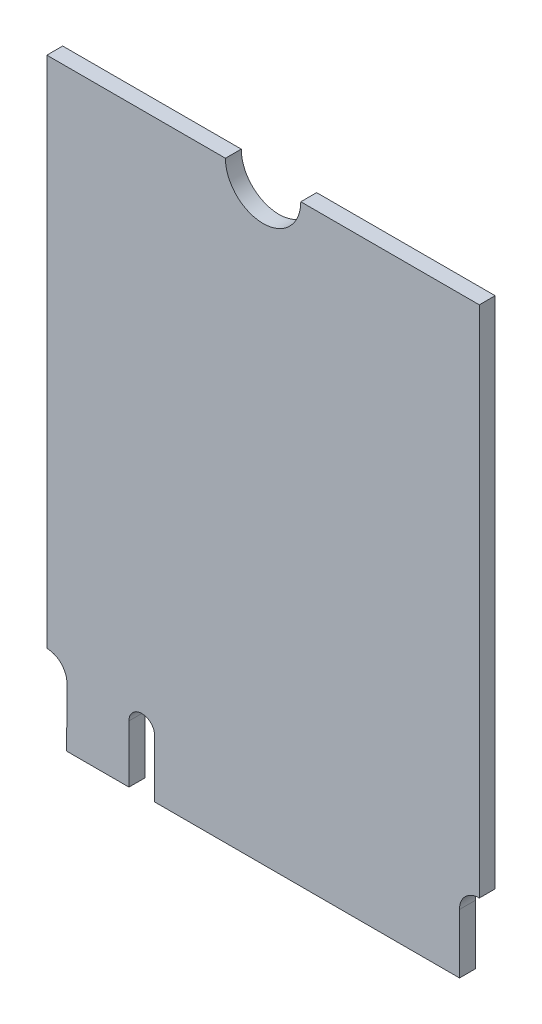
ISO-10303-21;
HEADER;
FILE_DESCRIPTION(('STEP AP214'),'2;1');
FILE_NAME('part.step','',(''),(''),'','','');
FILE_SCHEMA(('AUTOMOTIVE_DESIGN { 1 0 10303 214 1 1 1 1 }'));
ENDSEC;
DATA;
#1=APPLICATION_CONTEXT('core data for automotive mechanical design processes');
#2=APPLICATION_PROTOCOL_DEFINITION('international standard','automotive_design',2000,#1);
#3=PRODUCT_CONTEXT('',#1,'mechanical');
#4=PRODUCT('Part','Part','',(#3));
#5=PRODUCT_RELATED_PRODUCT_CATEGORY('part','',(#4));
#6=PRODUCT_DEFINITION_FORMATION('','',#4);
#7=PRODUCT_DEFINITION_CONTEXT('part definition',#1,'design');
#8=PRODUCT_DEFINITION('design','',#6,#7);
#9=PRODUCT_DEFINITION_SHAPE('','',#8);
#10=(LENGTH_UNIT() NAMED_UNIT(*) SI_UNIT(.MILLI.,.METRE.));
#11=(NAMED_UNIT(*) PLANE_ANGLE_UNIT() SI_UNIT($,.RADIAN.));
#12=(NAMED_UNIT(*) SI_UNIT($,.STERADIAN.) SOLID_ANGLE_UNIT());
#13=UNCERTAINTY_MEASURE_WITH_UNIT(LENGTH_MEASURE(1.E-05),#10,'distance_accuracy_value','');
#14=(GEOMETRIC_REPRESENTATION_CONTEXT(3) GLOBAL_UNCERTAINTY_ASSIGNED_CONTEXT((#13)) GLOBAL_UNIT_ASSIGNED_CONTEXT((#10,
#11,#12)) REPRESENTATION_CONTEXT('',''));
#15=CARTESIAN_POINT('',(0.,0.,0.));
#16=DIRECTION('',(0.,0.,1.));
#17=DIRECTION('',(1.,0.,0.));
#18=AXIS2_PLACEMENT_3D('',#15,#16,#17);
#19=CARTESIAN_POINT('',(41.631999969482,40.89400100708,0.));
#20=DIRECTION('',(-0.99998563687939,0.00535966742629409,0.));
#21=DIRECTION('',(0.00535966742629409,0.99998563687939,0.));
#22=AXIS2_PLACEMENT_3D('',#19,#20,#21);
#23=PLANE('',#22);
#24=DIRECTION('',(0.,0.,1.));
#25=VECTOR('',#24,1.);
#26=CARTESIAN_POINT('',(41.631999969482,40.89400100708,0.));
#27=LINE('',#26,#25);
#28=CARTESIAN_POINT('',(41.631999969482,40.89400100708,0.));
#29=VERTEX_POINT('',#28);
#30=CARTESIAN_POINT('',(41.631999969482,40.89400100708,0.80000094));
#31=VERTEX_POINT('',#30);
#32=EDGE_CURVE('E11',#29,#31,#27,.T.);
#33=ORIENTED_EDGE('',*,*,#32,.T.);
#34=DIRECTION('',(0.00535966742629409,0.99998563687939,0.));
#35=VECTOR('',#34,1.);
#36=CARTESIAN_POINT('',(41.631999969482,40.89400100708,0.80000094));
#37=LINE('',#36,#35);
#38=CARTESIAN_POINT('',(41.647998809814,43.879001617432,0.80000094));
#39=VERTEX_POINT('',#38);
#40=EDGE_CURVE('E25',#31,#39,#37,.T.);
#41=ORIENTED_EDGE('',*,*,#40,.T.);
#42=DIRECTION('',(0.,0.,1.));
#43=VECTOR('',#42,1.);
#44=CARTESIAN_POINT('',(41.647998809814,43.879001617432,0.));
#45=LINE('',#44,#43);
#46=CARTESIAN_POINT('',(41.647998809814,43.879001617432,0.));
#47=VERTEX_POINT('',#46);
#48=EDGE_CURVE('E136',#47,#39,#45,.T.);
#49=ORIENTED_EDGE('',*,*,#48,.F.);
#50=DIRECTION('',(0.00535966742629409,0.99998563687939,0.));
#51=VECTOR('',#50,1.);
#52=CARTESIAN_POINT('',(41.631999969482,40.89400100708,0.));
#53=LINE('',#52,#51);
#54=EDGE_CURVE('E251',#29,#47,#53,.T.);
#55=ORIENTED_EDGE('',*,*,#54,.F.);
#56=EDGE_LOOP('',(#33,#41,#49,#55));
#57=FACE_BOUND('',#56,.T.);
#58=ADVANCED_FACE('F17',(#57),#23,.T.);
#59=CARTESIAN_POINT('',(51.20604516011,55.499784448257,0.));
#60=DIRECTION('',(0.,0.,-1.));
#61=DIRECTION('',(-1.,0.,0.));
#62=AXIS2_PLACEMENT_3D('',#59,#60,#61);
#63=PLANE('',#62);
#64=ORIENTED_EDGE('',*,*,#54,.T.);
#65=CARTESIAN_POINT('',(40.632275211298,43.879276859248,0.));
#66=DIRECTION('',(0.,0.,1.));
#67=DIRECTION('',(0.999999963284646,-0.000270981009192204,0.));
#68=AXIS2_PLACEMENT_3D('',#65,#66,#67);
#69=CIRCLE('',#68,1.015723635809);
#70=CARTESIAN_POINT('',(40.631999969482,44.895000457764,0.));
#71=VERTEX_POINT('',#70);
#72=EDGE_CURVE('E247',#47,#71,#69,.T.);
#73=ORIENTED_EDGE('',*,*,#72,.T.);
#74=DIRECTION('',(0.,1.,0.));
#75=VECTOR('',#74,1.);
#76=CARTESIAN_POINT('',(40.631999969482,44.895000457764,0.));
#77=LINE('',#76,#75);
#78=CARTESIAN_POINT('',(40.631999969482,70.862998962402,0.));
#79=VERTEX_POINT('',#78);
#80=EDGE_CURVE('E130',#71,#79,#77,.T.);
#81=ORIENTED_EDGE('',*,*,#80,.T.);
#82=DIRECTION('',(1.,0.,0.));
#83=VECTOR('',#82,1.);
#84=CARTESIAN_POINT('',(40.631999969482,70.862998962402,0.));
#85=LINE('',#84,#83);
#86=CARTESIAN_POINT('',(49.658000946045,70.862998962402,0.));
#87=VERTEX_POINT('',#86);
#88=EDGE_CURVE('E240',#79,#87,#85,.T.);
#89=ORIENTED_EDGE('',*,*,#88,.T.);
#90=CARTESIAN_POINT('',(51.562999725342,70.862998962402,0.));
#91=DIRECTION('',(0.,0.,1.));
#92=DIRECTION('',(-1.,0.,0.));
#93=AXIS2_PLACEMENT_3D('',#90,#91,#92);
#94=CIRCLE('',#93,1.904998779297);
#95=CARTESIAN_POINT('',(53.467998504639,70.862998962402,0.));
#96=VERTEX_POINT('',#95);
#97=EDGE_CURVE('E236',#87,#96,#94,.T.);
#98=ORIENTED_EDGE('',*,*,#97,.T.);
#99=DIRECTION('',(1.,0.,0.));
#100=VECTOR('',#99,1.);
#101=CARTESIAN_POINT('',(53.467998504639,70.862998962402,0.));
#102=LINE('',#101,#100);
#103=CARTESIAN_POINT('',(62.492000579834,70.862998962402,0.));
#104=VERTEX_POINT('',#103);
#105=EDGE_CURVE('E232',#96,#104,#102,.T.);
#106=ORIENTED_EDGE('',*,*,#105,.T.);
#107=DIRECTION('',(0.,-1.,0.));
#108=VECTOR('',#107,1.);
#109=CARTESIAN_POINT('',(62.492000579834,70.862998962402,0.));
#110=LINE('',#109,#108);
#111=CARTESIAN_POINT('',(62.492000579834,44.89400100708,0.));
#112=VERTEX_POINT('',#111);
#113=EDGE_CURVE('E228',#104,#112,#110,.T.);
#114=ORIENTED_EDGE('',*,*,#113,.T.);
#115=CARTESIAN_POINT('',(62.482082937081,43.903918649833,0.));
#116=DIRECTION('',(0.,0.,1.));
#117=DIRECTION('',(0.0100164851431336,0.999949833754363,0.));
#118=AXIS2_PLACEMENT_3D('',#115,#116,#117);
#119=CIRCLE('',#118,0.990132028454);
#120=CARTESIAN_POINT('',(61.492000579834,43.89400100708,0.));
#121=VERTEX_POINT('',#120);
#122=EDGE_CURVE('E224',#112,#121,#119,.T.);
#123=ORIENTED_EDGE('',*,*,#122,.T.);
#124=DIRECTION('',(0.,-1.,0.));
#125=VECTOR('',#124,1.);
#126=CARTESIAN_POINT('',(61.492000579834,43.89400100708,0.));
#127=LINE('',#126,#125);
#128=CARTESIAN_POINT('',(61.492000579834,40.89400100708,0.));
#129=VERTEX_POINT('',#128);
#130=EDGE_CURVE('E220',#121,#129,#127,.T.);
#131=ORIENTED_EDGE('',*,*,#130,.T.);
#132=DIRECTION('',(-1.,0.,0.));
#133=VECTOR('',#132,1.);
#134=CARTESIAN_POINT('',(61.492000579834,40.89400100708,0.));
#135=LINE('',#134,#133);
#136=CARTESIAN_POINT('',(46.082000732422,40.89400100708,0.));
#137=VERTEX_POINT('',#136);
#138=EDGE_CURVE('E216',#129,#137,#135,.T.);
#139=ORIENTED_EDGE('',*,*,#138,.T.);
#140=DIRECTION('',(0.,1.,0.));
#141=VECTOR('',#140,1.);
#142=CARTESIAN_POINT('',(46.082000732422,40.89400100708,0.));
#143=LINE('',#142,#141);
#144=CARTESIAN_POINT('',(46.082000732422,43.793998718262,0.));
#145=VERTEX_POINT('',#144);
#146=EDGE_CURVE('E212',#137,#145,#143,.T.);
#147=ORIENTED_EDGE('',*,*,#146,.T.);
#148=CARTESIAN_POINT('',(45.432001113892,43.79400062561,0.));
#149=DIRECTION('',(0.,0.,1.));
#150=DIRECTION('',(0.999999999995695,-2.9343842341261E-06,0.));
#151=AXIS2_PLACEMENT_3D('',#148,#149,#150);
#152=CIRCLE('',#151,0.649999618533);
#153=CARTESIAN_POINT('',(44.782001495361,43.793998718262,0.));
#154=VERTEX_POINT('',#153);
#155=EDGE_CURVE('E208',#145,#154,#152,.T.);
#156=ORIENTED_EDGE('',*,*,#155,.T.);
#157=DIRECTION('',(0.,-1.,0.));
#158=VECTOR('',#157,1.);
#159=CARTESIAN_POINT('',(44.782001495361,43.793998718262,0.));
#160=LINE('',#159,#158);
#161=CARTESIAN_POINT('',(44.782001495361,40.89400100708,0.));
#162=VERTEX_POINT('',#161);
#163=EDGE_CURVE('E204',#154,#162,#160,.T.);
#164=ORIENTED_EDGE('',*,*,#163,.T.);
#165=DIRECTION('',(-1.,0.,0.));
#166=VECTOR('',#165,1.);
#167=CARTESIAN_POINT('',(44.782001495361,40.89400100708,0.));
#168=LINE('',#167,#166);
#169=EDGE_CURVE('E199',#162,#29,#168,.T.);
#170=ORIENTED_EDGE('',*,*,#169,.T.);
#171=EDGE_LOOP('',(#64,#73,#81,#89,#98,#106,#114,#123,#131,#139,#147,#156,#164,#170));
#172=FACE_BOUND('',#171,.T.);
#173=ADVANCED_FACE('F264',(#172),#63,.T.);
#174=CARTESIAN_POINT('',(44.782001495361,40.89400100708,0.));
#175=DIRECTION('',(0.,-1.,0.));
#176=DIRECTION('',(-1.,0.,0.));
#177=AXIS2_PLACEMENT_3D('',#174,#175,#176);
#178=PLANE('',#177);
#179=DIRECTION('',(0.,0.,1.));
#180=VECTOR('',#179,1.);
#181=CARTESIAN_POINT('',(44.782001495361,40.89400100708,0.));
#182=LINE('',#181,#180);
#183=CARTESIAN_POINT('',(44.782001495361,40.89400100708,0.80000094));
#184=VERTEX_POINT('',#183);
#185=EDGE_CURVE('E195',#162,#184,#182,.T.);
#186=ORIENTED_EDGE('',*,*,#185,.T.);
#187=DIRECTION('',(-1.,0.,0.));
#188=VECTOR('',#187,1.);
#189=CARTESIAN_POINT('',(44.782001495361,40.89400100708,0.80000094));
#190=LINE('',#189,#188);
#191=EDGE_CURVE('E191',#184,#31,#190,.T.);
#192=ORIENTED_EDGE('',*,*,#191,.T.);
#193=ORIENTED_EDGE('',*,*,#32,.F.);
#194=ORIENTED_EDGE('',*,*,#169,.F.);
#195=EDGE_LOOP('',(#186,#192,#193,#194));
#196=FACE_BOUND('',#195,.T.);
#197=ADVANCED_FACE('F271',(#196),#178,.T.);
#198=CARTESIAN_POINT('',(51.20604516011,55.499784448257,0.80000094));
#199=DIRECTION('',(0.,0.,-1.));
#200=DIRECTION('',(-1.,0.,0.));
#201=AXIS2_PLACEMENT_3D('',#198,#199,#200);
#202=PLANE('',#201);
#203=ORIENTED_EDGE('',*,*,#191,.F.);
#204=DIRECTION('',(0.,-1.,0.));
#205=VECTOR('',#204,1.);
#206=CARTESIAN_POINT('',(44.782001495361,43.793998718262,0.80000094));
#207=LINE('',#206,#205);
#208=CARTESIAN_POINT('',(44.782001495361,43.793998718262,0.80000094));
#209=VERTEX_POINT('',#208);
#210=EDGE_CURVE('E186',#209,#184,#207,.T.);
#211=ORIENTED_EDGE('',*,*,#210,.F.);
#212=CARTESIAN_POINT('',(45.432001113892,43.79400062561,0.80000094));
#213=DIRECTION('',(0.,0.,1.));
#214=DIRECTION('',(0.999999999995695,-2.9343842341261E-06,0.));
#215=AXIS2_PLACEMENT_3D('',#212,#213,#214);
#216=CIRCLE('',#215,0.649999618533);
#217=CARTESIAN_POINT('',(46.082000732422,43.793998718262,0.80000094));
#218=VERTEX_POINT('',#217);
#219=EDGE_CURVE('E181',#218,#209,#216,.T.);
#220=ORIENTED_EDGE('',*,*,#219,.F.);
#221=DIRECTION('',(0.,1.,0.));
#222=VECTOR('',#221,1.);
#223=CARTESIAN_POINT('',(46.082000732422,40.89400100708,0.80000094));
#224=LINE('',#223,#222);
#225=CARTESIAN_POINT('',(46.082000732422,40.89400100708,0.80000094));
#226=VERTEX_POINT('',#225);
#227=EDGE_CURVE('E176',#226,#218,#224,.T.);
#228=ORIENTED_EDGE('',*,*,#227,.F.);
#229=DIRECTION('',(-1.,0.,0.));
#230=VECTOR('',#229,1.);
#231=CARTESIAN_POINT('',(61.492000579834,40.89400100708,0.80000094));
#232=LINE('',#231,#230);
#233=CARTESIAN_POINT('',(61.492000579834,40.89400100708,0.80000094));
#234=VERTEX_POINT('',#233);
#235=EDGE_CURVE('E171',#234,#226,#232,.T.);
#236=ORIENTED_EDGE('',*,*,#235,.F.);
#237=DIRECTION('',(0.,-1.,0.));
#238=VECTOR('',#237,1.);
#239=CARTESIAN_POINT('',(61.492000579834,43.89400100708,0.80000094));
#240=LINE('',#239,#238);
#241=CARTESIAN_POINT('',(61.492000579834,43.89400100708,0.80000094));
#242=VERTEX_POINT('',#241);
#243=EDGE_CURVE('E166',#242,#234,#240,.T.);
#244=ORIENTED_EDGE('',*,*,#243,.F.);
#245=CARTESIAN_POINT('',(62.482082937081,43.903918649833,0.80000094));
#246=DIRECTION('',(0.,0.,1.));
#247=DIRECTION('',(0.0100164851431336,0.999949833754363,0.));
#248=AXIS2_PLACEMENT_3D('',#245,#246,#247);
#249=CIRCLE('',#248,0.990132028454);
#250=CARTESIAN_POINT('',(62.492000579834,44.89400100708,0.80000094));
#251=VERTEX_POINT('',#250);
#252=EDGE_CURVE('E161',#251,#242,#249,.T.);
#253=ORIENTED_EDGE('',*,*,#252,.F.);
#254=DIRECTION('',(0.,-1.,0.));
#255=VECTOR('',#254,1.);
#256=CARTESIAN_POINT('',(62.492000579834,70.862998962402,0.80000094));
#257=LINE('',#256,#255);
#258=CARTESIAN_POINT('',(62.492000579834,70.862998962402,0.80000094));
#259=VERTEX_POINT('',#258);
#260=EDGE_CURVE('E156',#259,#251,#257,.T.);
#261=ORIENTED_EDGE('',*,*,#260,.F.);
#262=DIRECTION('',(1.,0.,0.));
#263=VECTOR('',#262,1.);
#264=CARTESIAN_POINT('',(53.467998504639,70.862998962402,0.80000094));
#265=LINE('',#264,#263);
#266=CARTESIAN_POINT('',(53.467998504639,70.862998962402,0.80000094));
#267=VERTEX_POINT('',#266);
#268=EDGE_CURVE('E151',#267,#259,#265,.T.);
#269=ORIENTED_EDGE('',*,*,#268,.F.);
#270=CARTESIAN_POINT('',(51.562999725342,70.862998962402,0.80000094));
#271=DIRECTION('',(0.,0.,1.));
#272=DIRECTION('',(-1.,0.,0.));
#273=AXIS2_PLACEMENT_3D('',#270,#271,#272);
#274=CIRCLE('',#273,1.904998779297);
#275=CARTESIAN_POINT('',(49.658000946045,70.862998962402,0.80000094));
#276=VERTEX_POINT('',#275);
#277=EDGE_CURVE('E146',#276,#267,#274,.T.);
#278=ORIENTED_EDGE('',*,*,#277,.F.);
#279=DIRECTION('',(1.,0.,0.));
#280=VECTOR('',#279,1.);
#281=CARTESIAN_POINT('',(40.631999969482,70.862998962402,0.80000094));
#282=LINE('',#281,#280);
#283=CARTESIAN_POINT('',(40.631999969482,70.862998962402,0.80000094));
#284=VERTEX_POINT('',#283);
#285=EDGE_CURVE('E121',#284,#276,#282,.T.);
#286=ORIENTED_EDGE('',*,*,#285,.F.);
#287=DIRECTION('',(0.,1.,0.));
#288=VECTOR('',#287,1.);
#289=CARTESIAN_POINT('',(40.631999969482,44.895000457764,0.80000094));
#290=LINE('',#289,#288);
#291=CARTESIAN_POINT('',(40.631999969482,44.895000457764,0.80000094));
#292=VERTEX_POINT('',#291);
#293=EDGE_CURVE('E113',#292,#284,#290,.T.);
#294=ORIENTED_EDGE('',*,*,#293,.F.);
#295=CARTESIAN_POINT('',(40.632275211298,43.879276859248,0.80000094));
#296=DIRECTION('',(0.,0.,1.));
#297=DIRECTION('',(0.999999963284646,-0.000270981009192204,0.));
#298=AXIS2_PLACEMENT_3D('',#295,#296,#297);
#299=CIRCLE('',#298,1.015723635809);
#300=EDGE_CURVE('E118',#39,#292,#299,.T.);
#301=ORIENTED_EDGE('',*,*,#300,.F.);
#302=ORIENTED_EDGE('',*,*,#40,.F.);
#303=EDGE_LOOP('',(#203,#211,#220,#228,#236,#244,#253,#261,#269,#278,#286,#294,#301,#302));
#304=FACE_BOUND('',#303,.T.);
#305=ADVANCED_FACE('F116',(#304),#202,.F.);
#306=CARTESIAN_POINT('',(40.632275211298,43.879276859248,0.));
#307=DIRECTION('',(0.,0.,-1.));
#308=DIRECTION('',(-0.707106781186548,-0.707106781186547,0.));
#309=AXIS2_PLACEMENT_3D('',#306,#307,#308);
#310=CYLINDRICAL_SURFACE('',#309,1.015723635809);
#311=ORIENTED_EDGE('',*,*,#48,.T.);
#312=ORIENTED_EDGE('',*,*,#300,.T.);
#313=DIRECTION('',(0.,0.,1.));
#314=VECTOR('',#313,1.);
#315=CARTESIAN_POINT('',(40.631999969482,44.895000457764,0.));
#316=LINE('',#315,#314);
#317=EDGE_CURVE('E128',#71,#292,#316,.T.);
#318=ORIENTED_EDGE('',*,*,#317,.F.);
#319=ORIENTED_EDGE('',*,*,#72,.F.);
#320=EDGE_LOOP('',(#311,#312,#318,#319));
#321=FACE_BOUND('',#320,.T.);
#322=ADVANCED_FACE('F135',(#321),#310,.F.);
#323=CARTESIAN_POINT('',(40.631999969482,44.895000457764,0.));
#324=DIRECTION('',(-1.,0.,0.));
#325=DIRECTION('',(0.,1.,0.));
#326=AXIS2_PLACEMENT_3D('',#323,#324,#325);
#327=PLANE('',#326);
#328=ORIENTED_EDGE('',*,*,#317,.T.);
#329=ORIENTED_EDGE('',*,*,#293,.T.);
#330=DIRECTION('',(0.,0.,1.));
#331=VECTOR('',#330,1.);
#332=CARTESIAN_POINT('',(40.631999969482,70.862998962402,0.));
#333=LINE('',#332,#331);
#334=EDGE_CURVE('E133',#79,#284,#333,.T.);
#335=ORIENTED_EDGE('',*,*,#334,.F.);
#336=ORIENTED_EDGE('',*,*,#80,.F.);
#337=EDGE_LOOP('',(#328,#329,#335,#336));
#338=FACE_BOUND('',#337,.T.);
#339=ADVANCED_FACE('F129',(#338),#327,.T.);
#340=CARTESIAN_POINT('',(40.631999969482,70.862998962402,0.));
#341=DIRECTION('',(0.,1.,0.));
#342=DIRECTION('',(1.,0.,0.));
#343=AXIS2_PLACEMENT_3D('',#340,#341,#342);
#344=PLANE('',#343);
#345=ORIENTED_EDGE('',*,*,#334,.T.);
#346=ORIENTED_EDGE('',*,*,#285,.T.);
#347=DIRECTION('',(0.,0.,1.));
#348=VECTOR('',#347,1.);
#349=CARTESIAN_POINT('',(49.658000946045,70.862998962402,0.));
#350=LINE('',#349,#348);
#351=EDGE_CURVE('E368',#87,#276,#350,.T.);
#352=ORIENTED_EDGE('',*,*,#351,.F.);
#353=ORIENTED_EDGE('',*,*,#88,.F.);
#354=EDGE_LOOP('',(#345,#346,#352,#353));
#355=FACE_BOUND('',#354,.T.);
#356=ADVANCED_FACE('F286',(#355),#344,.T.);
#357=CARTESIAN_POINT('',(51.562999725342,70.862998962402,0.));
#358=DIRECTION('',(0.,0.,-1.));
#359=DIRECTION('',(0.,1.,0.));
#360=AXIS2_PLACEMENT_3D('',#357,#358,#359);
#361=CYLINDRICAL_SURFACE('',#360,1.904998779297);
#362=ORIENTED_EDGE('',*,*,#351,.T.);
#363=ORIENTED_EDGE('',*,*,#277,.T.);
#364=DIRECTION('',(0.,0.,1.));
#365=VECTOR('',#364,1.);
#366=CARTESIAN_POINT('',(53.467998504639,70.862998962402,0.));
#367=LINE('',#366,#365);
#368=EDGE_CURVE('E361',#96,#267,#367,.T.);
#369=ORIENTED_EDGE('',*,*,#368,.F.);
#370=ORIENTED_EDGE('',*,*,#97,.F.);
#371=EDGE_LOOP('',(#362,#363,#369,#370));
#372=FACE_BOUND('',#371,.T.);
#373=ADVANCED_FACE('F289',(#372),#361,.F.);
#374=CARTESIAN_POINT('',(53.467998504639,70.862998962402,0.));
#375=DIRECTION('',(0.,1.,0.));
#376=DIRECTION('',(1.,0.,0.));
#377=AXIS2_PLACEMENT_3D('',#374,#375,#376);
#378=PLANE('',#377);
#379=ORIENTED_EDGE('',*,*,#368,.T.);
#380=ORIENTED_EDGE('',*,*,#268,.T.);
#381=DIRECTION('',(0.,0.,1.));
#382=VECTOR('',#381,1.);
#383=CARTESIAN_POINT('',(62.492000579834,70.862998962402,0.));
#384=LINE('',#383,#382);
#385=EDGE_CURVE('E357',#104,#259,#384,.T.);
#386=ORIENTED_EDGE('',*,*,#385,.F.);
#387=ORIENTED_EDGE('',*,*,#105,.F.);
#388=EDGE_LOOP('',(#379,#380,#386,#387));
#389=FACE_BOUND('',#388,.T.);
#390=ADVANCED_FACE('F293',(#389),#378,.T.);
#391=CARTESIAN_POINT('',(62.492000579834,70.862998962402,0.));
#392=DIRECTION('',(1.,0.,0.));
#393=DIRECTION('',(0.,-1.,0.));
#394=AXIS2_PLACEMENT_3D('',#391,#392,#393);
#395=PLANE('',#394);
#396=ORIENTED_EDGE('',*,*,#385,.T.);
#397=ORIENTED_EDGE('',*,*,#260,.T.);
#398=DIRECTION('',(0.,0.,1.));
#399=VECTOR('',#398,1.);
#400=CARTESIAN_POINT('',(62.492000579834,44.89400100708,0.));
#401=LINE('',#400,#399);
#402=EDGE_CURVE('E355',#112,#251,#401,.T.);
#403=ORIENTED_EDGE('',*,*,#402,.F.);
#404=ORIENTED_EDGE('',*,*,#113,.F.);
#405=EDGE_LOOP('',(#396,#397,#403,#404));
#406=FACE_BOUND('',#405,.T.);
#407=ADVANCED_FACE('F297',(#406),#395,.T.);
#408=CARTESIAN_POINT('',(62.482082937081,43.903918649833,0.));
#409=DIRECTION('',(0.,0.,-1.));
#410=DIRECTION('',(0.70710678453975,-0.707106777833345,0.));
#411=AXIS2_PLACEMENT_3D('',#408,#409,#410);
#412=CYLINDRICAL_SURFACE('',#411,0.990132028454);
#413=ORIENTED_EDGE('',*,*,#402,.T.);
#414=ORIENTED_EDGE('',*,*,#252,.T.);
#415=DIRECTION('',(0.,0.,1.));
#416=VECTOR('',#415,1.);
#417=CARTESIAN_POINT('',(61.492000579834,43.89400100708,0.));
#418=LINE('',#417,#416);
#419=EDGE_CURVE('E347',#121,#242,#418,.T.);
#420=ORIENTED_EDGE('',*,*,#419,.F.);
#421=ORIENTED_EDGE('',*,*,#122,.F.);
#422=EDGE_LOOP('',(#413,#414,#420,#421));
#423=FACE_BOUND('',#422,.T.);
#424=ADVANCED_FACE('F301',(#423),#412,.F.);
#425=CARTESIAN_POINT('',(61.492000579834,43.89400100708,0.));
#426=DIRECTION('',(1.,0.,0.));
#427=DIRECTION('',(0.,-1.,0.));
#428=AXIS2_PLACEMENT_3D('',#425,#426,#427);
#429=PLANE('',#428);
#430=ORIENTED_EDGE('',*,*,#419,.T.);
#431=ORIENTED_EDGE('',*,*,#243,.T.);
#432=DIRECTION('',(0.,0.,1.));
#433=VECTOR('',#432,1.);
#434=CARTESIAN_POINT('',(61.492000579834,40.89400100708,0.));
#435=LINE('',#434,#433);
#436=EDGE_CURVE('E343',#129,#234,#435,.T.);
#437=ORIENTED_EDGE('',*,*,#436,.F.);
#438=ORIENTED_EDGE('',*,*,#130,.F.);
#439=EDGE_LOOP('',(#430,#431,#437,#438));
#440=FACE_BOUND('',#439,.T.);
#441=ADVANCED_FACE('F305',(#440),#429,.T.);
#442=CARTESIAN_POINT('',(61.492000579834,40.89400100708,0.));
#443=DIRECTION('',(0.,-1.,0.));
#444=DIRECTION('',(-1.,0.,0.));
#445=AXIS2_PLACEMENT_3D('',#442,#443,#444);
#446=PLANE('',#445);
#447=ORIENTED_EDGE('',*,*,#436,.T.);
#448=ORIENTED_EDGE('',*,*,#235,.T.);
#449=DIRECTION('',(0.,0.,1.));
#450=VECTOR('',#449,1.);
#451=CARTESIAN_POINT('',(46.082000732422,40.89400100708,0.));
#452=LINE('',#451,#450);
#453=EDGE_CURVE('E341',#137,#226,#452,.T.);
#454=ORIENTED_EDGE('',*,*,#453,.F.);
#455=ORIENTED_EDGE('',*,*,#138,.F.);
#456=EDGE_LOOP('',(#447,#448,#454,#455));
#457=FACE_BOUND('',#456,.T.);
#458=ADVANCED_FACE('F309',(#457),#446,.T.);
#459=CARTESIAN_POINT('',(46.082000732422,40.89400100708,0.));
#460=DIRECTION('',(-1.,0.,0.));
#461=DIRECTION('',(0.,1.,0.));
#462=AXIS2_PLACEMENT_3D('',#459,#460,#461);
#463=PLANE('',#462);
#464=ORIENTED_EDGE('',*,*,#453,.T.);
#465=ORIENTED_EDGE('',*,*,#227,.T.);
#466=DIRECTION('',(0.,0.,1.));
#467=VECTOR('',#466,1.);
#468=CARTESIAN_POINT('',(46.082000732422,43.793998718262,0.));
#469=LINE('',#468,#467);
#470=EDGE_CURVE('E333',#145,#218,#469,.T.);
#471=ORIENTED_EDGE('',*,*,#470,.F.);
#472=ORIENTED_EDGE('',*,*,#146,.F.);
#473=EDGE_LOOP('',(#464,#465,#471,#472));
#474=FACE_BOUND('',#473,.T.);
#475=ADVANCED_FACE('F313',(#474),#463,.T.);
#476=CARTESIAN_POINT('',(45.432001113892,43.79400062561,0.));
#477=DIRECTION('',(0.,0.,-1.));
#478=DIRECTION('',(-4.86525349596299E-13,-1.,0.));
#479=AXIS2_PLACEMENT_3D('',#476,#477,#478);
#480=CYLINDRICAL_SURFACE('',#479,0.649999618533);
#481=ORIENTED_EDGE('',*,*,#470,.T.);
#482=ORIENTED_EDGE('',*,*,#219,.T.);
#483=DIRECTION('',(0.,0.,1.));
#484=VECTOR('',#483,1.);
#485=CARTESIAN_POINT('',(44.782001495361,43.793998718262,0.));
#486=LINE('',#485,#484);
#487=EDGE_CURVE('E330',#154,#209,#486,.T.);
#488=ORIENTED_EDGE('',*,*,#487,.F.);
#489=ORIENTED_EDGE('',*,*,#155,.F.);
#490=EDGE_LOOP('',(#481,#482,#488,#489));
#491=FACE_BOUND('',#490,.T.);
#492=ADVANCED_FACE('F317',(#491),#480,.F.);
#493=CARTESIAN_POINT('',(44.782001495361,43.793998718262,0.));
#494=DIRECTION('',(1.,0.,0.));
#495=DIRECTION('',(0.,-1.,0.));
#496=AXIS2_PLACEMENT_3D('',#493,#494,#495);
#497=PLANE('',#496);
#498=ORIENTED_EDGE('',*,*,#487,.T.);
#499=ORIENTED_EDGE('',*,*,#210,.T.);
#500=ORIENTED_EDGE('',*,*,#185,.F.);
#501=ORIENTED_EDGE('',*,*,#163,.F.);
#502=EDGE_LOOP('',(#498,#499,#500,#501));
#503=FACE_BOUND('',#502,.T.);
#504=ADVANCED_FACE('F321',(#503),#497,.T.);
#505=CLOSED_SHELL('',(#58,#173,#197,#305,#322,#339,#356,#373,#390,#407,#424,#441,#458,#475,#492,#504));
#506=MANIFOLD_SOLID_BREP('B1',#505);
#507=ADVANCED_BREP_SHAPE_REPRESENTATION('',(#18,#506),#14);
#508=SHAPE_DEFINITION_REPRESENTATION(#9,#507);
ENDSEC;
END-ISO-10303-21;
